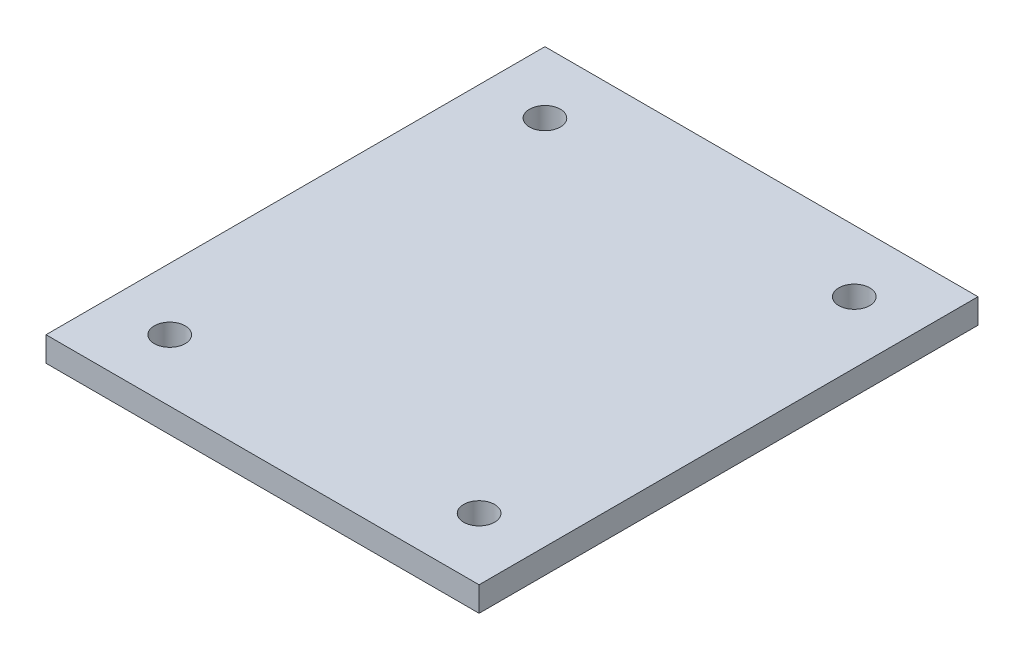
ISO-10303-21;
HEADER;
FILE_DESCRIPTION(('STEP AP214'),'2;1');
FILE_NAME('part.step','',(''),(''),'','','');
FILE_SCHEMA(('AUTOMOTIVE_DESIGN { 1 0 10303 214 1 1 1 1 }'));
ENDSEC;
DATA;
#1=APPLICATION_CONTEXT('core data for automotive mechanical design processes');
#2=APPLICATION_PROTOCOL_DEFINITION('international standard','automotive_design',2000,#1);
#3=PRODUCT_CONTEXT('',#1,'mechanical');
#4=PRODUCT('Part','Part','',(#3));
#5=PRODUCT_RELATED_PRODUCT_CATEGORY('part','',(#4));
#6=PRODUCT_DEFINITION_FORMATION('','',#4);
#7=PRODUCT_DEFINITION_CONTEXT('part definition',#1,'design');
#8=PRODUCT_DEFINITION('design','',#6,#7);
#9=PRODUCT_DEFINITION_SHAPE('','',#8);
#10=(LENGTH_UNIT() NAMED_UNIT(*) SI_UNIT(.MILLI.,.METRE.));
#11=(NAMED_UNIT(*) PLANE_ANGLE_UNIT() SI_UNIT($,.RADIAN.));
#12=(NAMED_UNIT(*) SI_UNIT($,.STERADIAN.) SOLID_ANGLE_UNIT());
#13=UNCERTAINTY_MEASURE_WITH_UNIT(LENGTH_MEASURE(1.E-05),#10,'distance_accuracy_value','');
#14=(GEOMETRIC_REPRESENTATION_CONTEXT(3) GLOBAL_UNCERTAINTY_ASSIGNED_CONTEXT((#13)) GLOBAL_UNIT_ASSIGNED_CONTEXT((#10,
#11,#12)) REPRESENTATION_CONTEXT('',''));
#15=CARTESIAN_POINT('',(0.,0.,0.));
#16=DIRECTION('',(0.,0.,1.));
#17=DIRECTION('',(1.,0.,0.));
#18=AXIS2_PLACEMENT_3D('',#15,#16,#17);
#19=CARTESIAN_POINT('',(0.,4.,0.));
#20=DIRECTION('',(1.,0.,0.));
#21=DIRECTION('',(0.,0.,-1.));
#22=AXIS2_PLACEMENT_3D('',#19,#20,#21);
#23=PLANE('',#22);
#24=DIRECTION('',(0.,0.,1.));
#25=VECTOR('',#24,1.);
#26=CARTESIAN_POINT('',(0.,0.,0.));
#27=LINE('',#26,#25);
#28=CARTESIAN_POINT('',(0.,0.,-80.64));
#29=VERTEX_POINT('',#28);
#30=CARTESIAN_POINT('',(0.,0.,0.));
#31=VERTEX_POINT('',#30);
#32=EDGE_CURVE('E96',#29,#31,#27,.T.);
#33=ORIENTED_EDGE('',*,*,#32,.T.);
#34=DIRECTION('',(0.,-1.,0.));
#35=VECTOR('',#34,1.);
#36=CARTESIAN_POINT('',(0.,4.,0.));
#37=LINE('',#36,#35);
#38=CARTESIAN_POINT('',(0.,4.,0.));
#39=VERTEX_POINT('',#38);
#40=EDGE_CURVE('E11',#39,#31,#37,.T.);
#41=ORIENTED_EDGE('',*,*,#40,.F.);
#42=DIRECTION('',(0.,0.,1.));
#43=VECTOR('',#42,1.);
#44=CARTESIAN_POINT('',(0.,4.,0.));
#45=LINE('',#44,#43);
#46=CARTESIAN_POINT('',(0.,4.,-80.64));
#47=VERTEX_POINT('',#46);
#48=EDGE_CURVE('E84',#47,#39,#45,.T.);
#49=ORIENTED_EDGE('',*,*,#48,.F.);
#50=DIRECTION('',(0.,-1.,0.));
#51=VECTOR('',#50,1.);
#52=CARTESIAN_POINT('',(0.,4.,-80.64));
#53=LINE('',#52,#51);
#54=EDGE_CURVE('E92',#47,#29,#53,.T.);
#55=ORIENTED_EDGE('',*,*,#54,.T.);
#56=EDGE_LOOP('',(#33,#41,#49,#55));
#57=FACE_BOUND('',#56,.T.);
#58=ADVANCED_FACE('F33',(#57),#23,.F.);
#59=CARTESIAN_POINT('',(0.,4.,0.));
#60=DIRECTION('',(0.,0.,-1.));
#61=DIRECTION('',(-1.,0.,0.));
#62=AXIS2_PLACEMENT_3D('',#59,#60,#61);
#63=PLANE('',#62);
#64=DIRECTION('',(1.,0.,0.));
#65=VECTOR('',#64,1.);
#66=CARTESIAN_POINT('',(0.,0.,0.));
#67=LINE('',#66,#65);
#68=CARTESIAN_POINT('',(70.,0.,0.));
#69=VERTEX_POINT('',#68);
#70=EDGE_CURVE('E88',#31,#69,#67,.T.);
#71=ORIENTED_EDGE('',*,*,#70,.T.);
#72=DIRECTION('',(0.,-1.,0.));
#73=VECTOR('',#72,1.);
#74=CARTESIAN_POINT('',(70.,4.,0.));
#75=LINE('',#74,#73);
#76=CARTESIAN_POINT('',(70.,4.,0.));
#77=VERTEX_POINT('',#76);
#78=EDGE_CURVE('E41',#77,#69,#75,.T.);
#79=ORIENTED_EDGE('',*,*,#78,.F.);
#80=DIRECTION('',(1.,0.,0.));
#81=VECTOR('',#80,1.);
#82=CARTESIAN_POINT('',(0.,4.,0.));
#83=LINE('',#82,#81);
#84=EDGE_CURVE('E79',#39,#77,#83,.T.);
#85=ORIENTED_EDGE('',*,*,#84,.F.);
#86=ORIENTED_EDGE('',*,*,#40,.T.);
#87=EDGE_LOOP('',(#71,#79,#85,#86));
#88=FACE_BOUND('',#87,.T.);
#89=ADVANCED_FACE('F87',(#88),#63,.F.);
#90=CARTESIAN_POINT('',(70.,4.,0.));
#91=DIRECTION('',(-1.,0.,0.));
#92=DIRECTION('',(0.,0.,1.));
#93=AXIS2_PLACEMENT_3D('',#90,#91,#92);
#94=PLANE('',#93);
#95=DIRECTION('',(0.,0.,-1.));
#96=VECTOR('',#95,1.);
#97=CARTESIAN_POINT('',(70.,0.,0.));
#98=LINE('',#97,#96);
#99=CARTESIAN_POINT('',(70.,0.,-80.64));
#100=VERTEX_POINT('',#99);
#101=EDGE_CURVE('E66',#69,#100,#98,.T.);
#102=ORIENTED_EDGE('',*,*,#101,.T.);
#103=DIRECTION('',(0.,-1.,0.));
#104=VECTOR('',#103,1.);
#105=CARTESIAN_POINT('',(70.,4.,-80.64));
#106=LINE('',#105,#104);
#107=CARTESIAN_POINT('',(70.,4.,-80.64));
#108=VERTEX_POINT('',#107);
#109=EDGE_CURVE('E89',#108,#100,#106,.T.);
#110=ORIENTED_EDGE('',*,*,#109,.F.);
#111=DIRECTION('',(0.,0.,-1.));
#112=VECTOR('',#111,1.);
#113=CARTESIAN_POINT('',(70.,4.,0.));
#114=LINE('',#113,#112);
#115=EDGE_CURVE('E82',#77,#108,#114,.T.);
#116=ORIENTED_EDGE('',*,*,#115,.F.);
#117=ORIENTED_EDGE('',*,*,#78,.T.);
#118=EDGE_LOOP('',(#102,#110,#116,#117));
#119=FACE_BOUND('',#118,.T.);
#120=ADVANCED_FACE('F90',(#119),#94,.F.);
#121=CARTESIAN_POINT('',(0.,4.,-80.64));
#122=DIRECTION('',(0.,0.,1.));
#123=DIRECTION('',(1.,0.,0.));
#124=AXIS2_PLACEMENT_3D('',#121,#122,#123);
#125=PLANE('',#124);
#126=DIRECTION('',(-1.,0.,0.));
#127=VECTOR('',#126,1.);
#128=CARTESIAN_POINT('',(0.,0.,-80.64));
#129=LINE('',#128,#127);
#130=EDGE_CURVE('E72',#100,#29,#129,.T.);
#131=ORIENTED_EDGE('',*,*,#130,.T.);
#132=ORIENTED_EDGE('',*,*,#54,.F.);
#133=DIRECTION('',(-1.,0.,0.));
#134=VECTOR('',#133,1.);
#135=CARTESIAN_POINT('',(0.,4.,-80.64));
#136=LINE('',#135,#134);
#137=EDGE_CURVE('E49',#108,#47,#136,.T.);
#138=ORIENTED_EDGE('',*,*,#137,.F.);
#139=ORIENTED_EDGE('',*,*,#109,.T.);
#140=EDGE_LOOP('',(#131,#132,#138,#139));
#141=FACE_BOUND('',#140,.T.);
#142=ADVANCED_FACE('F104',(#141),#125,.F.);
#143=CARTESIAN_POINT('',(0.,4.,0.));
#144=DIRECTION('',(0.,-1.,0.));
#145=DIRECTION('',(0.,0.,-1.));
#146=AXIS2_PLACEMENT_3D('',#143,#144,#145);
#147=PLANE('',#146);
#148=CARTESIAN_POINT('',(10.,4.,-10.));
#149=DIRECTION('',(0.,1.,0.));
#150=DIRECTION('',(0.,0.,1.));
#151=AXIS2_PLACEMENT_3D('',#148,#149,#150);
#152=CIRCLE('',#151,2.5);
#153=CARTESIAN_POINT('',(10.,4.,-7.5));
#154=VERTEX_POINT('',#153);
#155=EDGE_CURVE('E128',#154,#154,#152,.T.);
#156=ORIENTED_EDGE('',*,*,#155,.F.);
#157=EDGE_LOOP('',(#156));
#158=FACE_BOUND('',#157,.T.);
#159=CARTESIAN_POINT('',(60.,4.,-9.99999999999999));
#160=DIRECTION('',(0.,1.,0.));
#161=DIRECTION('',(0.,0.,1.));
#162=AXIS2_PLACEMENT_3D('',#159,#160,#161);
#163=CIRCLE('',#162,2.5);
#164=CARTESIAN_POINT('',(60.,4.,-7.49999999999999));
#165=VERTEX_POINT('',#164);
#166=EDGE_CURVE('E122',#165,#165,#163,.T.);
#167=ORIENTED_EDGE('',*,*,#166,.F.);
#168=EDGE_LOOP('',(#167));
#169=FACE_BOUND('',#168,.T.);
#170=CARTESIAN_POINT('',(60.,4.,-70.64));
#171=DIRECTION('',(0.,1.,0.));
#172=DIRECTION('',(0.,0.,1.));
#173=AXIS2_PLACEMENT_3D('',#170,#171,#172);
#174=CIRCLE('',#173,2.50000000000001);
#175=CARTESIAN_POINT('',(60.,4.,-68.14));
#176=VERTEX_POINT('',#175);
#177=EDGE_CURVE('E116',#176,#176,#174,.T.);
#178=ORIENTED_EDGE('',*,*,#177,.F.);
#179=EDGE_LOOP('',(#178));
#180=FACE_BOUND('',#179,.T.);
#181=CARTESIAN_POINT('',(10.,4.,-70.64));
#182=DIRECTION('',(0.,1.,0.));
#183=DIRECTION('',(0.,0.,1.));
#184=AXIS2_PLACEMENT_3D('',#181,#182,#183);
#185=CIRCLE('',#184,2.5);
#186=CARTESIAN_POINT('',(10.,4.,-68.14));
#187=VERTEX_POINT('',#186);
#188=EDGE_CURVE('E110',#187,#187,#185,.T.);
#189=ORIENTED_EDGE('',*,*,#188,.F.);
#190=EDGE_LOOP('',(#189));
#191=FACE_BOUND('',#190,.T.);
#192=ORIENTED_EDGE('',*,*,#48,.T.);
#193=ORIENTED_EDGE('',*,*,#84,.T.);
#194=ORIENTED_EDGE('',*,*,#115,.T.);
#195=ORIENTED_EDGE('',*,*,#137,.T.);
#196=EDGE_LOOP('',(#192,#193,#194,#195));
#197=FACE_BOUND('',#196,.T.);
#198=ADVANCED_FACE('F80',(#158,#169,#180,#191,#197),#147,.F.);
#199=CARTESIAN_POINT('',(0.,0.,0.));
#200=DIRECTION('',(0.,-1.,0.));
#201=DIRECTION('',(0.,0.,-1.));
#202=AXIS2_PLACEMENT_3D('',#199,#200,#201);
#203=PLANE('',#202);
#204=CARTESIAN_POINT('',(10.,0.,-10.));
#205=DIRECTION('',(0.,1.,0.));
#206=DIRECTION('',(0.,0.,1.));
#207=AXIS2_PLACEMENT_3D('',#204,#205,#206);
#208=CIRCLE('',#207,2.5);
#209=CARTESIAN_POINT('',(10.,0.,-7.5));
#210=VERTEX_POINT('',#209);
#211=EDGE_CURVE('E125',#210,#210,#208,.T.);
#212=ORIENTED_EDGE('',*,*,#211,.T.);
#213=EDGE_LOOP('',(#212));
#214=FACE_BOUND('',#213,.T.);
#215=CARTESIAN_POINT('',(60.,0.,-9.99999999999999));
#216=DIRECTION('',(0.,1.,0.));
#217=DIRECTION('',(0.,0.,1.));
#218=AXIS2_PLACEMENT_3D('',#215,#216,#217);
#219=CIRCLE('',#218,2.5);
#220=CARTESIAN_POINT('',(60.,0.,-7.49999999999999));
#221=VERTEX_POINT('',#220);
#222=EDGE_CURVE('E119',#221,#221,#219,.T.);
#223=ORIENTED_EDGE('',*,*,#222,.T.);
#224=EDGE_LOOP('',(#223));
#225=FACE_BOUND('',#224,.T.);
#226=CARTESIAN_POINT('',(60.,0.,-70.64));
#227=DIRECTION('',(0.,1.,0.));
#228=DIRECTION('',(0.,0.,1.));
#229=AXIS2_PLACEMENT_3D('',#226,#227,#228);
#230=CIRCLE('',#229,2.50000000000001);
#231=CARTESIAN_POINT('',(60.,0.,-68.14));
#232=VERTEX_POINT('',#231);
#233=EDGE_CURVE('E113',#232,#232,#230,.T.);
#234=ORIENTED_EDGE('',*,*,#233,.T.);
#235=EDGE_LOOP('',(#234));
#236=FACE_BOUND('',#235,.T.);
#237=CARTESIAN_POINT('',(10.,0.,-70.64));
#238=DIRECTION('',(0.,1.,0.));
#239=DIRECTION('',(0.,0.,1.));
#240=AXIS2_PLACEMENT_3D('',#237,#238,#239);
#241=CIRCLE('',#240,2.5);
#242=CARTESIAN_POINT('',(10.,0.,-68.14));
#243=VERTEX_POINT('',#242);
#244=EDGE_CURVE('E99',#243,#243,#241,.T.);
#245=ORIENTED_EDGE('',*,*,#244,.T.);
#246=EDGE_LOOP('',(#245));
#247=FACE_BOUND('',#246,.T.);
#248=ORIENTED_EDGE('',*,*,#32,.F.);
#249=ORIENTED_EDGE('',*,*,#130,.F.);
#250=ORIENTED_EDGE('',*,*,#101,.F.);
#251=ORIENTED_EDGE('',*,*,#70,.F.);
#252=EDGE_LOOP('',(#248,#249,#250,#251));
#253=FACE_BOUND('',#252,.T.);
#254=ADVANCED_FACE('F107',(#214,#225,#236,#247,#253),#203,.T.);
#255=CARTESIAN_POINT('',(10.,0.,-70.64));
#256=DIRECTION('',(0.,1.,0.));
#257=DIRECTION('',(0.,0.,1.));
#258=AXIS2_PLACEMENT_3D('',#255,#256,#257);
#259=CYLINDRICAL_SURFACE('',#258,2.5);
#260=ORIENTED_EDGE('',*,*,#244,.F.);
#261=EDGE_LOOP('',(#260));
#262=FACE_BOUND('',#261,.T.);
#263=ORIENTED_EDGE('',*,*,#188,.T.);
#264=EDGE_LOOP('',(#263));
#265=FACE_BOUND('',#264,.T.);
#266=ADVANCED_FACE('F152',(#262,#265),#259,.F.);
#267=CARTESIAN_POINT('',(60.,0.,-70.64));
#268=DIRECTION('',(0.,1.,0.));
#269=DIRECTION('',(0.,0.,1.));
#270=AXIS2_PLACEMENT_3D('',#267,#268,#269);
#271=CYLINDRICAL_SURFACE('',#270,2.50000000000001);
#272=ORIENTED_EDGE('',*,*,#233,.F.);
#273=EDGE_LOOP('',(#272));
#274=FACE_BOUND('',#273,.T.);
#275=ORIENTED_EDGE('',*,*,#177,.T.);
#276=EDGE_LOOP('',(#275));
#277=FACE_BOUND('',#276,.T.);
#278=ADVANCED_FACE('F154',(#274,#277),#271,.F.);
#279=CARTESIAN_POINT('',(60.,0.,-9.99999999999999));
#280=DIRECTION('',(0.,1.,0.));
#281=DIRECTION('',(0.,0.,1.));
#282=AXIS2_PLACEMENT_3D('',#279,#280,#281);
#283=CYLINDRICAL_SURFACE('',#282,2.5);
#284=ORIENTED_EDGE('',*,*,#222,.F.);
#285=EDGE_LOOP('',(#284));
#286=FACE_BOUND('',#285,.T.);
#287=ORIENTED_EDGE('',*,*,#166,.T.);
#288=EDGE_LOOP('',(#287));
#289=FACE_BOUND('',#288,.T.);
#290=ADVANCED_FACE('F139',(#286,#289),#283,.F.);
#291=CARTESIAN_POINT('',(10.,0.,-10.));
#292=DIRECTION('',(0.,1.,0.));
#293=DIRECTION('',(0.,0.,1.));
#294=AXIS2_PLACEMENT_3D('',#291,#292,#293);
#295=CYLINDRICAL_SURFACE('',#294,2.5);
#296=ORIENTED_EDGE('',*,*,#211,.F.);
#297=EDGE_LOOP('',(#296));
#298=FACE_BOUND('',#297,.T.);
#299=ORIENTED_EDGE('',*,*,#155,.T.);
#300=EDGE_LOOP('',(#299));
#301=FACE_BOUND('',#300,.T.);
#302=ADVANCED_FACE('F136',(#298,#301),#295,.F.);
#303=CLOSED_SHELL('',(#58,#89,#120,#142,#198,#254,#266,#278,#290,#302));
#304=MANIFOLD_SOLID_BREP('B2',#303);
#305=ADVANCED_BREP_SHAPE_REPRESENTATION('',(#18,#304),#14);
#306=SHAPE_DEFINITION_REPRESENTATION(#9,#305);
ENDSEC;
END-ISO-10303-21;
